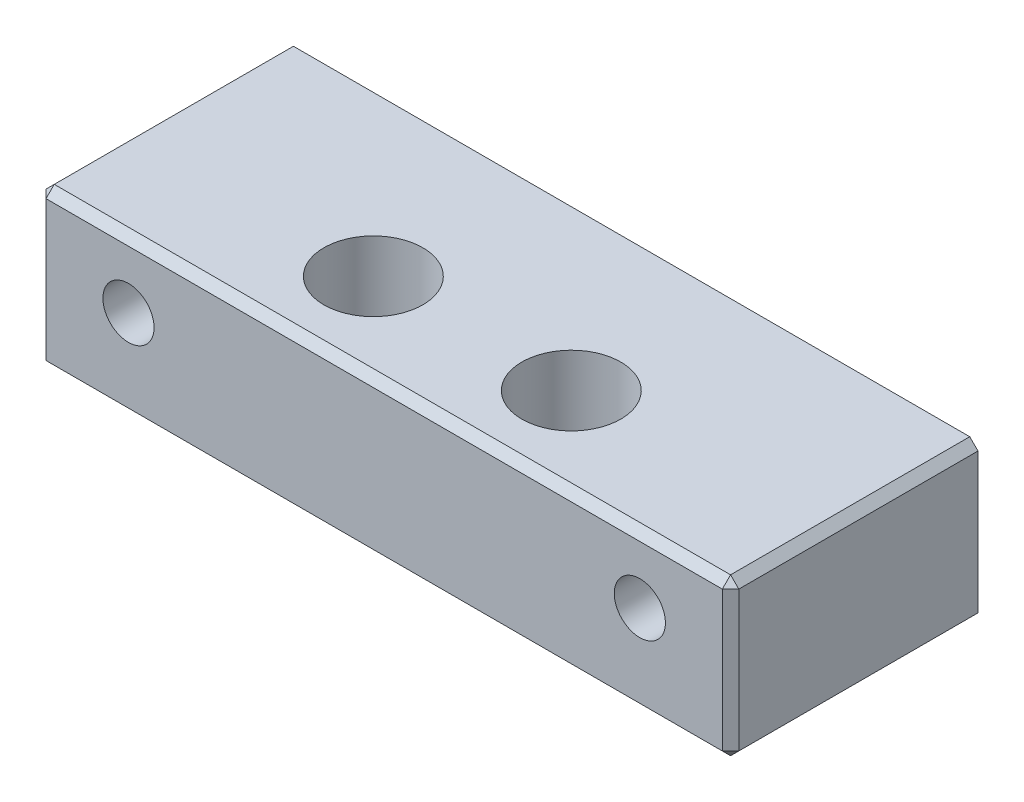
ISO-10303-21;
HEADER;
FILE_DESCRIPTION(('STEP AP214'),'2;1');
FILE_NAME('part.step','',(''),(''),'','','');
FILE_SCHEMA(('AUTOMOTIVE_DESIGN { 1 0 10303 214 1 1 1 1 }'));
ENDSEC;
DATA;
#1=APPLICATION_CONTEXT('core data for automotive mechanical design processes');
#2=APPLICATION_PROTOCOL_DEFINITION('international standard','automotive_design',2000,#1);
#3=PRODUCT_CONTEXT('',#1,'mechanical');
#4=PRODUCT('Part','Part','',(#3));
#5=PRODUCT_RELATED_PRODUCT_CATEGORY('part','',(#4));
#6=PRODUCT_DEFINITION_FORMATION('','',#4);
#7=PRODUCT_DEFINITION_CONTEXT('part definition',#1,'design');
#8=PRODUCT_DEFINITION('design','',#6,#7);
#9=PRODUCT_DEFINITION_SHAPE('','',#8);
#10=(LENGTH_UNIT() NAMED_UNIT(*) SI_UNIT(.MILLI.,.METRE.));
#11=(NAMED_UNIT(*) PLANE_ANGLE_UNIT() SI_UNIT($,.RADIAN.));
#12=(NAMED_UNIT(*) SI_UNIT($,.STERADIAN.) SOLID_ANGLE_UNIT());
#13=UNCERTAINTY_MEASURE_WITH_UNIT(LENGTH_MEASURE(1.E-05),#10,'distance_accuracy_value','');
#14=(GEOMETRIC_REPRESENTATION_CONTEXT(3) GLOBAL_UNCERTAINTY_ASSIGNED_CONTEXT((#13)) GLOBAL_UNIT_ASSIGNED_CONTEXT((#10,
#11,#12)) REPRESENTATION_CONTEXT('',''));
#15=CARTESIAN_POINT('',(0.,0.,0.));
#16=DIRECTION('',(0.,0.,1.));
#17=DIRECTION('',(1.,0.,0.));
#18=AXIS2_PLACEMENT_3D('',#15,#16,#17);
#19=CARTESIAN_POINT('',(21.,-4.75,7.5));
#20=DIRECTION('',(-1.,0.,0.));
#21=DIRECTION('',(0.,0.,1.));
#22=AXIS2_PLACEMENT_3D('',#19,#20,#21);
#23=PLANE('',#22);
#24=DIRECTION('',(0.,1.,0.));
#25=VECTOR('',#24,1.);
#26=CARTESIAN_POINT('',(21.,-4.75,-7.5));
#27=LINE('',#26,#25);
#28=CARTESIAN_POINT('',(21.,-4.25,-7.5));
#29=VERTEX_POINT('',#28);
#30=CARTESIAN_POINT('',(21.,4.24999999999999,-7.5));
#31=VERTEX_POINT('',#30);
#32=EDGE_CURVE('E143',#29,#31,#27,.T.);
#33=ORIENTED_EDGE('',*,*,#32,.T.);
#34=DIRECTION('',(0.,0.,1.));
#35=VECTOR('',#34,1.);
#36=CARTESIAN_POINT('',(21.,4.24999999999999,7.5));
#37=LINE('',#36,#35);
#38=CARTESIAN_POINT('',(21.,4.24999999999999,6.99999999999999));
#39=VERTEX_POINT('',#38);
#40=EDGE_CURVE('E120',#31,#39,#37,.T.);
#41=ORIENTED_EDGE('',*,*,#40,.T.);
#42=DIRECTION('',(0.,-1.,0.));
#43=VECTOR('',#42,1.);
#44=CARTESIAN_POINT('',(21.,-4.75,6.99999999999999));
#45=LINE('',#44,#43);
#46=CARTESIAN_POINT('',(21.,-4.25,6.99999999999999));
#47=VERTEX_POINT('',#46);
#48=EDGE_CURVE('E125',#39,#47,#45,.T.);
#49=ORIENTED_EDGE('',*,*,#48,.T.);
#50=DIRECTION('',(0.,0.,-1.));
#51=VECTOR('',#50,1.);
#52=CARTESIAN_POINT('',(21.,-4.25,7.5));
#53=LINE('',#52,#51);
#54=EDGE_CURVE('E160',#47,#29,#53,.T.);
#55=ORIENTED_EDGE('',*,*,#54,.T.);
#56=EDGE_LOOP('',(#33,#41,#49,#55));
#57=FACE_BOUND('',#56,.T.);
#58=ADVANCED_FACE('F34',(#57),#23,.F.);
#59=CARTESIAN_POINT('',(-21.,4.75,7.5));
#60=DIRECTION('',(0.,-1.,0.));
#61=DIRECTION('',(0.,0.,-1.));
#62=AXIS2_PLACEMENT_3D('',#59,#60,#61);
#63=PLANE('',#62);
#64=CARTESIAN_POINT('',(-6.,4.75,2.155));
#65=DIRECTION('',(0.,1.,0.));
#66=DIRECTION('',(0.,0.,1.));
#67=AXIS2_PLACEMENT_3D('',#64,#65,#66);
#68=CIRCLE('',#67,3.);
#69=CARTESIAN_POINT('',(-6.,4.75,5.155));
#70=VERTEX_POINT('',#69);
#71=EDGE_CURVE('E210',#70,#70,#68,.T.);
#72=ORIENTED_EDGE('',*,*,#71,.F.);
#73=EDGE_LOOP('',(#72));
#74=FACE_BOUND('',#73,.T.);
#75=CARTESIAN_POINT('',(6.,4.75,2.155));
#76=DIRECTION('',(0.,1.,0.));
#77=DIRECTION('',(0.,0.,1.));
#78=AXIS2_PLACEMENT_3D('',#75,#76,#77);
#79=CIRCLE('',#78,3.);
#80=CARTESIAN_POINT('',(6.,4.75,5.155));
#81=VERTEX_POINT('',#80);
#82=EDGE_CURVE('E220',#81,#81,#79,.T.);
#83=ORIENTED_EDGE('',*,*,#82,.F.);
#84=EDGE_LOOP('',(#83));
#85=FACE_BOUND('',#84,.T.);
#86=DIRECTION('',(1.,0.,0.));
#87=VECTOR('',#86,1.);
#88=CARTESIAN_POINT('',(-21.,4.75,6.99999999999999));
#89=LINE('',#88,#87);
#90=CARTESIAN_POINT('',(-20.5,4.75,6.99999999999999));
#91=VERTEX_POINT('',#90);
#92=CARTESIAN_POINT('',(20.5,4.75,6.99999999999999));
#93=VERTEX_POINT('',#92);
#94=EDGE_CURVE('E134',#91,#93,#89,.T.);
#95=ORIENTED_EDGE('',*,*,#94,.T.);
#96=DIRECTION('',(0.,0.,-1.));
#97=VECTOR('',#96,1.);
#98=CARTESIAN_POINT('',(20.5,4.75,7.5));
#99=LINE('',#98,#97);
#100=CARTESIAN_POINT('',(20.5,4.75,-7.5));
#101=VERTEX_POINT('',#100);
#102=EDGE_CURVE('E119',#93,#101,#99,.T.);
#103=ORIENTED_EDGE('',*,*,#102,.T.);
#104=DIRECTION('',(-1.,0.,0.));
#105=VECTOR('',#104,1.);
#106=CARTESIAN_POINT('',(-21.,4.75,-7.5));
#107=LINE('',#106,#105);
#108=CARTESIAN_POINT('',(-20.5,4.75,-7.5));
#109=VERTEX_POINT('',#108);
#110=EDGE_CURVE('E131',#101,#109,#107,.T.);
#111=ORIENTED_EDGE('',*,*,#110,.T.);
#112=DIRECTION('',(0.,0.,1.));
#113=VECTOR('',#112,1.);
#114=CARTESIAN_POINT('',(-20.5,4.75,7.5));
#115=LINE('',#114,#113);
#116=EDGE_CURVE('E136',#109,#91,#115,.T.);
#117=ORIENTED_EDGE('',*,*,#116,.T.);
#118=EDGE_LOOP('',(#95,#103,#111,#117));
#119=FACE_BOUND('',#118,.T.);
#120=ADVANCED_FACE('F130',(#74,#85,#119),#63,.F.);
#121=CARTESIAN_POINT('',(-21.,-4.75,7.5));
#122=DIRECTION('',(1.,0.,0.));
#123=DIRECTION('',(0.,0.,-1.));
#124=AXIS2_PLACEMENT_3D('',#121,#122,#123);
#125=PLANE('',#124);
#126=DIRECTION('',(0.,1.,0.));
#127=VECTOR('',#126,1.);
#128=CARTESIAN_POINT('',(-21.,-4.75,6.99999999999999));
#129=LINE('',#128,#127);
#130=CARTESIAN_POINT('',(-21.,-4.24999999999999,6.99999999999999));
#131=VERTEX_POINT('',#130);
#132=CARTESIAN_POINT('',(-21.,4.24999999999999,6.99999999999999));
#133=VERTEX_POINT('',#132);
#134=EDGE_CURVE('E169',#131,#133,#129,.T.);
#135=ORIENTED_EDGE('',*,*,#134,.T.);
#136=DIRECTION('',(0.,0.,-1.));
#137=VECTOR('',#136,1.);
#138=CARTESIAN_POINT('',(-21.,4.24999999999999,7.5));
#139=LINE('',#138,#137);
#140=CARTESIAN_POINT('',(-21.,4.25,-7.5));
#141=VERTEX_POINT('',#140);
#142=EDGE_CURVE('E173',#133,#141,#139,.T.);
#143=ORIENTED_EDGE('',*,*,#142,.T.);
#144=DIRECTION('',(0.,-1.,0.));
#145=VECTOR('',#144,1.);
#146=CARTESIAN_POINT('',(-21.,-4.75,-7.5));
#147=LINE('',#146,#145);
#148=CARTESIAN_POINT('',(-21.,-4.24999999999999,-7.5));
#149=VERTEX_POINT('',#148);
#150=EDGE_CURVE('E142',#141,#149,#147,.T.);
#151=ORIENTED_EDGE('',*,*,#150,.T.);
#152=DIRECTION('',(0.,0.,1.));
#153=VECTOR('',#152,1.);
#154=CARTESIAN_POINT('',(-21.,-4.24999999999999,7.5));
#155=LINE('',#154,#153);
#156=EDGE_CURVE('E171',#149,#131,#155,.T.);
#157=ORIENTED_EDGE('',*,*,#156,.T.);
#158=EDGE_LOOP('',(#135,#143,#151,#157));
#159=FACE_BOUND('',#158,.T.);
#160=ADVANCED_FACE('F251',(#159),#125,.F.);
#161=CARTESIAN_POINT('',(-21.,-4.75,7.5));
#162=DIRECTION('',(0.,1.,0.));
#163=DIRECTION('',(0.,0.,1.));
#164=AXIS2_PLACEMENT_3D('',#161,#162,#163);
#165=PLANE('',#164);
#166=DIRECTION('',(1.,0.,0.));
#167=VECTOR('',#166,1.);
#168=CARTESIAN_POINT('',(-21.,-4.75,-7.5));
#169=LINE('',#168,#167);
#170=CARTESIAN_POINT('',(-20.5,-4.75,-7.5));
#171=VERTEX_POINT('',#170);
#172=CARTESIAN_POINT('',(20.5,-4.75,-7.5));
#173=VERTEX_POINT('',#172);
#174=EDGE_CURVE('E146',#171,#173,#169,.T.);
#175=ORIENTED_EDGE('',*,*,#174,.T.);
#176=DIRECTION('',(0.,0.,1.));
#177=VECTOR('',#176,1.);
#178=CARTESIAN_POINT('',(20.5,-4.75,7.5));
#179=LINE('',#178,#177);
#180=CARTESIAN_POINT('',(20.5,-4.75,6.99999999999999));
#181=VERTEX_POINT('',#180);
#182=EDGE_CURVE('E167',#173,#181,#179,.T.);
#183=ORIENTED_EDGE('',*,*,#182,.T.);
#184=DIRECTION('',(-1.,0.,0.));
#185=VECTOR('',#184,1.);
#186=CARTESIAN_POINT('',(-21.,-4.75,6.99999999999999));
#187=LINE('',#186,#185);
#188=CARTESIAN_POINT('',(-20.5,-4.75,6.99999999999999));
#189=VERTEX_POINT('',#188);
#190=EDGE_CURVE('E163',#181,#189,#187,.T.);
#191=ORIENTED_EDGE('',*,*,#190,.T.);
#192=DIRECTION('',(0.,0.,-1.));
#193=VECTOR('',#192,1.);
#194=CARTESIAN_POINT('',(-20.5,-4.75,7.5));
#195=LINE('',#194,#193);
#196=EDGE_CURVE('E165',#189,#171,#195,.T.);
#197=ORIENTED_EDGE('',*,*,#196,.T.);
#198=EDGE_LOOP('',(#175,#183,#191,#197));
#199=FACE_BOUND('',#198,.T.);
#200=CARTESIAN_POINT('',(-6.,-4.75,2.155));
#201=DIRECTION('',(0.,1.,0.));
#202=DIRECTION('',(0.,0.,1.));
#203=AXIS2_PLACEMENT_3D('',#200,#201,#202);
#204=CIRCLE('',#203,3.);
#205=CARTESIAN_POINT('',(-6.,-4.75,5.155));
#206=VERTEX_POINT('',#205);
#207=EDGE_CURVE('E215',#206,#206,#204,.T.);
#208=ORIENTED_EDGE('',*,*,#207,.T.);
#209=EDGE_LOOP('',(#208));
#210=FACE_BOUND('',#209,.T.);
#211=CARTESIAN_POINT('',(6.,-4.75,2.155));
#212=DIRECTION('',(0.,1.,0.));
#213=DIRECTION('',(0.,0.,1.));
#214=AXIS2_PLACEMENT_3D('',#211,#212,#213);
#215=CIRCLE('',#214,3.);
#216=CARTESIAN_POINT('',(6.,-4.75,5.155));
#217=VERTEX_POINT('',#216);
#218=EDGE_CURVE('E223',#217,#217,#215,.T.);
#219=ORIENTED_EDGE('',*,*,#218,.T.);
#220=EDGE_LOOP('',(#219));
#221=FACE_BOUND('',#220,.T.);
#222=ADVANCED_FACE('F243',(#199,#210,#221),#165,.F.);
#223=CARTESIAN_POINT('',(21.,4.75,7.5));
#224=DIRECTION('',(0.,0.,-1.));
#225=DIRECTION('',(-1.,0.,0.));
#226=AXIS2_PLACEMENT_3D('',#223,#224,#225);
#227=PLANE('',#226);
#228=DIRECTION('',(1.,0.,0.));
#229=VECTOR('',#228,1.);
#230=CARTESIAN_POINT('',(21.,-4.25,7.5));
#231=LINE('',#230,#229);
#232=CARTESIAN_POINT('',(-20.5,-4.25,7.5));
#233=VERTEX_POINT('',#232);
#234=CARTESIAN_POINT('',(20.5,-4.25,7.5));
#235=VERTEX_POINT('',#234);
#236=EDGE_CURVE('E58',#233,#235,#231,.T.);
#237=ORIENTED_EDGE('',*,*,#236,.T.);
#238=DIRECTION('',(0.,1.,0.));
#239=VECTOR('',#238,1.);
#240=CARTESIAN_POINT('',(20.5,4.75,7.5));
#241=LINE('',#240,#239);
#242=CARTESIAN_POINT('',(20.5,4.25,7.5));
#243=VERTEX_POINT('',#242);
#244=EDGE_CURVE('E11',#235,#243,#241,.T.);
#245=ORIENTED_EDGE('',*,*,#244,.T.);
#246=DIRECTION('',(-1.,0.,0.));
#247=VECTOR('',#246,1.);
#248=CARTESIAN_POINT('',(21.,4.25,7.5));
#249=LINE('',#248,#247);
#250=CARTESIAN_POINT('',(-20.5,4.25,7.5));
#251=VERTEX_POINT('',#250);
#252=EDGE_CURVE('E43',#243,#251,#249,.T.);
#253=ORIENTED_EDGE('',*,*,#252,.T.);
#254=DIRECTION('',(0.,-1.,0.));
#255=VECTOR('',#254,1.);
#256=CARTESIAN_POINT('',(-20.5,4.75,7.5));
#257=LINE('',#256,#255);
#258=EDGE_CURVE('E175',#251,#233,#257,.T.);
#259=ORIENTED_EDGE('',*,*,#258,.T.);
#260=EDGE_LOOP('',(#237,#245,#253,#259));
#261=FACE_BOUND('',#260,.T.);
#262=CARTESIAN_POINT('',(15.5,0.750000000000005,7.5));
#263=DIRECTION('',(0.,0.,1.));
#264=DIRECTION('',(1.,0.,0.));
#265=AXIS2_PLACEMENT_3D('',#262,#263,#264);
#266=CIRCLE('',#265,1.55);
#267=CARTESIAN_POINT('',(17.05,0.750000000000005,7.5));
#268=VERTEX_POINT('',#267);
#269=EDGE_CURVE('E226',#268,#268,#266,.T.);
#270=ORIENTED_EDGE('',*,*,#269,.F.);
#271=EDGE_LOOP('',(#270));
#272=FACE_BOUND('',#271,.T.);
#273=CARTESIAN_POINT('',(-15.5,0.750000000000002,7.5));
#274=DIRECTION('',(0.,0.,1.));
#275=DIRECTION('',(1.,0.,0.));
#276=AXIS2_PLACEMENT_3D('',#273,#274,#275);
#277=CIRCLE('',#276,1.55);
#278=CARTESIAN_POINT('',(-13.95,0.750000000000002,7.5));
#279=VERTEX_POINT('',#278);
#280=EDGE_CURVE('E232',#279,#279,#277,.T.);
#281=ORIENTED_EDGE('',*,*,#280,.F.);
#282=EDGE_LOOP('',(#281));
#283=FACE_BOUND('',#282,.T.);
#284=ADVANCED_FACE('F241',(#261,#272,#283),#227,.F.);
#285=CARTESIAN_POINT('',(21.,4.75,-7.5));
#286=DIRECTION('',(0.,0.,-1.));
#287=DIRECTION('',(-1.,0.,0.));
#288=AXIS2_PLACEMENT_3D('',#285,#286,#287);
#289=PLANE('',#288);
#290=CARTESIAN_POINT('',(15.5,0.750000000000005,-7.5));
#291=DIRECTION('',(0.,0.,1.));
#292=DIRECTION('',(1.,0.,0.));
#293=AXIS2_PLACEMENT_3D('',#290,#291,#292);
#294=CIRCLE('',#293,1.55);
#295=CARTESIAN_POINT('',(17.05,0.750000000000005,-7.5));
#296=VERTEX_POINT('',#295);
#297=EDGE_CURVE('E229',#296,#296,#294,.T.);
#298=ORIENTED_EDGE('',*,*,#297,.T.);
#299=EDGE_LOOP('',(#298));
#300=FACE_BOUND('',#299,.T.);
#301=CARTESIAN_POINT('',(-15.5,0.750000000000002,-7.5));
#302=DIRECTION('',(0.,0.,1.));
#303=DIRECTION('',(1.,0.,0.));
#304=AXIS2_PLACEMENT_3D('',#301,#302,#303);
#305=CIRCLE('',#304,1.55);
#306=CARTESIAN_POINT('',(-13.95,0.750000000000002,-7.5));
#307=VERTEX_POINT('',#306);
#308=EDGE_CURVE('E148',#307,#307,#305,.T.);
#309=ORIENTED_EDGE('',*,*,#308,.T.);
#310=EDGE_LOOP('',(#309));
#311=FACE_BOUND('',#310,.T.);
#312=ORIENTED_EDGE('',*,*,#110,.F.);
#313=DIRECTION('',(-0.707106781186543,0.707106781186552,0.));
#314=VECTOR('',#313,1.);
#315=CARTESIAN_POINT('',(20.75,4.50000000000001,-7.5));
#316=LINE('',#315,#314);
#317=EDGE_CURVE('E115',#101,#31,#316,.F.);
#318=ORIENTED_EDGE('',*,*,#317,.T.);
#319=ORIENTED_EDGE('',*,*,#32,.F.);
#320=DIRECTION('',(0.707106781186552,0.707106781186543,0.));
#321=VECTOR('',#320,1.);
#322=CARTESIAN_POINT('',(25.5,0.249999999999932,-7.5));
#323=LINE('',#322,#321);
#324=EDGE_CURVE('E126',#29,#173,#323,.F.);
#325=ORIENTED_EDGE('',*,*,#324,.T.);
#326=ORIENTED_EDGE('',*,*,#174,.F.);
#327=DIRECTION('',(0.707106781186543,-0.707106781186552,0.));
#328=VECTOR('',#327,1.);
#329=CARTESIAN_POINT('',(-4.50000000000029,-20.7499999999999,-7.5));
#330=LINE('',#329,#328);
#331=EDGE_CURVE('E135',#171,#149,#330,.F.);
#332=ORIENTED_EDGE('',*,*,#331,.T.);
#333=ORIENTED_EDGE('',*,*,#150,.F.);
#334=DIRECTION('',(-0.707106781186543,-0.707106781186552,0.));
#335=VECTOR('',#334,1.);
#336=CARTESIAN_POINT('',(0.249999999999705,25.5,-7.5));
#337=LINE('',#336,#335);
#338=EDGE_CURVE('E141',#141,#109,#337,.F.);
#339=ORIENTED_EDGE('',*,*,#338,.T.);
#340=EDGE_LOOP('',(#312,#318,#319,#325,#326,#332,#333,#339));
#341=FACE_BOUND('',#340,.T.);
#342=ADVANCED_FACE('F138',(#300,#311,#341),#289,.T.);
#343=CARTESIAN_POINT('',(-15.5,0.750000000000002,-7.5));
#344=DIRECTION('',(0.,0.,1.));
#345=DIRECTION('',(1.,0.,0.));
#346=AXIS2_PLACEMENT_3D('',#343,#344,#345);
#347=CYLINDRICAL_SURFACE('',#346,1.55);
#348=ORIENTED_EDGE('',*,*,#308,.F.);
#349=EDGE_LOOP('',(#348));
#350=FACE_BOUND('',#349,.T.);
#351=ORIENTED_EDGE('',*,*,#280,.T.);
#352=EDGE_LOOP('',(#351));
#353=FACE_BOUND('',#352,.T.);
#354=ADVANCED_FACE('F239',(#350,#353),#347,.F.);
#355=CARTESIAN_POINT('',(15.5,0.750000000000005,-7.5));
#356=DIRECTION('',(0.,0.,1.));
#357=DIRECTION('',(1.,0.,0.));
#358=AXIS2_PLACEMENT_3D('',#355,#356,#357);
#359=CYLINDRICAL_SURFACE('',#358,1.55);
#360=ORIENTED_EDGE('',*,*,#297,.F.);
#361=EDGE_LOOP('',(#360));
#362=FACE_BOUND('',#361,.T.);
#363=ORIENTED_EDGE('',*,*,#269,.T.);
#364=EDGE_LOOP('',(#363));
#365=FACE_BOUND('',#364,.T.);
#366=ADVANCED_FACE('F335',(#362,#365),#359,.F.);
#367=CARTESIAN_POINT('',(6.,-4.75,2.155));
#368=DIRECTION('',(0.,1.,0.));
#369=DIRECTION('',(0.,0.,1.));
#370=AXIS2_PLACEMENT_3D('',#367,#368,#369);
#371=CYLINDRICAL_SURFACE('',#370,3.);
#372=ORIENTED_EDGE('',*,*,#218,.F.);
#373=EDGE_LOOP('',(#372));
#374=FACE_BOUND('',#373,.T.);
#375=ORIENTED_EDGE('',*,*,#82,.T.);
#376=EDGE_LOOP('',(#375));
#377=FACE_BOUND('',#376,.T.);
#378=ADVANCED_FACE('F332',(#374,#377),#371,.F.);
#379=CARTESIAN_POINT('',(-6.,-4.75,2.155));
#380=DIRECTION('',(0.,1.,0.));
#381=DIRECTION('',(0.,0.,1.));
#382=AXIS2_PLACEMENT_3D('',#379,#380,#381);
#383=CYLINDRICAL_SURFACE('',#382,3.);
#384=ORIENTED_EDGE('',*,*,#207,.F.);
#385=EDGE_LOOP('',(#384));
#386=FACE_BOUND('',#385,.T.);
#387=ORIENTED_EDGE('',*,*,#71,.T.);
#388=EDGE_LOOP('',(#387));
#389=FACE_BOUND('',#388,.T.);
#390=ADVANCED_FACE('F306',(#386,#389),#383,.F.);
#391=CARTESIAN_POINT('',(-20.5,-4.75,7.5));
#392=DIRECTION('',(0.707106781186552,0.707106781186542,0.));
#393=DIRECTION('',(-0.707106781186543,0.707106781186552,0.));
#394=AXIS2_PLACEMENT_3D('',#391,#392,#393);
#395=PLANE('',#394);
#396=DIRECTION('',(-0.707106781186543,0.707106781186552,0.));
#397=VECTOR('',#396,1.);
#398=CARTESIAN_POINT('',(-21.,-4.24999999999999,6.99999999999999));
#399=LINE('',#398,#397);
#400=EDGE_CURVE('E38',#131,#189,#399,.F.);
#401=ORIENTED_EDGE('',*,*,#400,.F.);
#402=ORIENTED_EDGE('',*,*,#156,.F.);
#403=ORIENTED_EDGE('',*,*,#331,.F.);
#404=ORIENTED_EDGE('',*,*,#196,.F.);
#405=EDGE_LOOP('',(#401,#402,#403,#404));
#406=FACE_BOUND('',#405,.T.);
#407=ADVANCED_FACE('F36',(#406),#395,.F.);
#408=CARTESIAN_POINT('',(-21.,-4.24999999999999,6.99999999999999));
#409=DIRECTION('',(-0.577350269189634,-0.577350269189626,0.577350269189618));
#410=DIRECTION('',(0.707106781186543,-0.707106781186552,0.));
#411=AXIS2_PLACEMENT_3D('',#408,#409,#410);
#412=PLANE('',#411);
#413=DIRECTION('',(0.707106781186543,0.,0.707106781186552));
#414=VECTOR('',#413,1.);
#415=CARTESIAN_POINT('',(-21.,-4.24999999999999,6.99999999999999));
#416=LINE('',#415,#414);
#417=EDGE_CURVE('E202',#131,#233,#416,.T.);
#418=ORIENTED_EDGE('',*,*,#417,.F.);
#419=ORIENTED_EDGE('',*,*,#400,.T.);
#420=DIRECTION('',(0.,-0.707106781186543,-0.707106781186552));
#421=VECTOR('',#420,1.);
#422=CARTESIAN_POINT('',(-20.5,-4.5,7.25));
#423=LINE('',#422,#421);
#424=EDGE_CURVE('E204',#233,#189,#423,.T.);
#425=ORIENTED_EDGE('',*,*,#424,.F.);
#426=EDGE_LOOP('',(#418,#419,#425));
#427=FACE_BOUND('',#426,.T.);
#428=ADVANCED_FACE('F300',(#427),#412,.T.);
#429=CARTESIAN_POINT('',(21.,-4.25,7.5));
#430=DIRECTION('',(-0.707106781186542,0.707106781186552,0.));
#431=DIRECTION('',(-0.707106781186552,-0.707106781186543,0.));
#432=AXIS2_PLACEMENT_3D('',#429,#430,#431);
#433=PLANE('',#432);
#434=ORIENTED_EDGE('',*,*,#324,.F.);
#435=ORIENTED_EDGE('',*,*,#54,.F.);
#436=DIRECTION('',(-0.707106781186552,-0.707106781186543,0.));
#437=VECTOR('',#436,1.);
#438=CARTESIAN_POINT('',(20.5,-4.75,6.99999999999999));
#439=LINE('',#438,#437);
#440=EDGE_CURVE('E199',#181,#47,#439,.F.);
#441=ORIENTED_EDGE('',*,*,#440,.F.);
#442=ORIENTED_EDGE('',*,*,#182,.F.);
#443=EDGE_LOOP('',(#434,#435,#441,#442));
#444=FACE_BOUND('',#443,.T.);
#445=ADVANCED_FACE('F298',(#444),#433,.F.);
#446=CARTESIAN_POINT('',(21.,-4.25,7.5));
#447=DIRECTION('',(0.,0.707106781186552,-0.707106781186542));
#448=DIRECTION('',(0.,0.707106781186543,0.707106781186552));
#449=AXIS2_PLACEMENT_3D('',#446,#447,#448);
#450=PLANE('',#449);
#451=ORIENTED_EDGE('',*,*,#424,.T.);
#452=ORIENTED_EDGE('',*,*,#190,.F.);
#453=DIRECTION('',(0.,0.707106781186543,0.707106781186552));
#454=VECTOR('',#453,1.);
#455=CARTESIAN_POINT('',(20.5,-4.75,6.99999999999999));
#456=LINE('',#455,#454);
#457=EDGE_CURVE('E196',#235,#181,#456,.F.);
#458=ORIENTED_EDGE('',*,*,#457,.F.);
#459=ORIENTED_EDGE('',*,*,#236,.F.);
#460=EDGE_LOOP('',(#451,#452,#458,#459));
#461=FACE_BOUND('',#460,.T.);
#462=ADVANCED_FACE('F294',(#461),#450,.F.);
#463=CARTESIAN_POINT('',(-20.5,4.75,7.5));
#464=DIRECTION('',(0.707106781186552,0.,-0.707106781186542));
#465=DIRECTION('',(-0.707106781186543,0.,-0.707106781186552));
#466=AXIS2_PLACEMENT_3D('',#463,#464,#465);
#467=PLANE('',#466);
#468=ORIENTED_EDGE('',*,*,#417,.T.);
#469=ORIENTED_EDGE('',*,*,#258,.F.);
#470=DIRECTION('',(-0.707106781186543,0.,-0.707106781186552));
#471=VECTOR('',#470,1.);
#472=CARTESIAN_POINT('',(-20.75,4.25,7.25));
#473=LINE('',#472,#471);
#474=EDGE_CURVE('E193',#133,#251,#473,.F.);
#475=ORIENTED_EDGE('',*,*,#474,.F.);
#476=ORIENTED_EDGE('',*,*,#134,.F.);
#477=EDGE_LOOP('',(#468,#469,#475,#476));
#478=FACE_BOUND('',#477,.T.);
#479=ADVANCED_FACE('F290',(#478),#467,.F.);
#480=CARTESIAN_POINT('',(-21.,4.24999999999999,7.5));
#481=DIRECTION('',(0.707106781186552,-0.707106781186542,0.));
#482=DIRECTION('',(0.707106781186543,0.707106781186552,0.));
#483=AXIS2_PLACEMENT_3D('',#480,#481,#482);
#484=PLANE('',#483);
#485=ORIENTED_EDGE('',*,*,#338,.F.);
#486=ORIENTED_EDGE('',*,*,#142,.F.);
#487=DIRECTION('',(0.707106781186543,0.707106781186552,0.));
#488=VECTOR('',#487,1.);
#489=CARTESIAN_POINT('',(-20.5,4.75,6.99999999999999));
#490=LINE('',#489,#488);
#491=EDGE_CURVE('E190',#91,#133,#490,.F.);
#492=ORIENTED_EDGE('',*,*,#491,.F.);
#493=ORIENTED_EDGE('',*,*,#116,.F.);
#494=EDGE_LOOP('',(#485,#486,#492,#493));
#495=FACE_BOUND('',#494,.T.);
#496=ADVANCED_FACE('F286',(#495),#484,.F.);
#497=CARTESIAN_POINT('',(20.5,-4.75,6.99999999999999));
#498=DIRECTION('',(0.577350269189626,-0.577350269189634,0.577350269189618));
#499=DIRECTION('',(0.707106781186552,0.707106781186543,0.));
#500=AXIS2_PLACEMENT_3D('',#497,#498,#499);
#501=PLANE('',#500);
#502=ORIENTED_EDGE('',*,*,#457,.T.);
#503=ORIENTED_EDGE('',*,*,#440,.T.);
#504=DIRECTION('',(0.707106781186543,0.,-0.707106781186552));
#505=VECTOR('',#504,1.);
#506=CARTESIAN_POINT('',(20.75,-4.25,7.25));
#507=LINE('',#506,#505);
#508=EDGE_CURVE('E187',#235,#47,#507,.T.);
#509=ORIENTED_EDGE('',*,*,#508,.F.);
#510=EDGE_LOOP('',(#502,#503,#509));
#511=FACE_BOUND('',#510,.T.);
#512=ADVANCED_FACE('F282',(#511),#501,.T.);
#513=CARTESIAN_POINT('',(-20.5,4.75,6.99999999999999));
#514=DIRECTION('',(-0.577350269189634,0.577350269189626,0.577350269189618));
#515=DIRECTION('',(-0.707106781186543,-0.707106781186552,0.));
#516=AXIS2_PLACEMENT_3D('',#513,#514,#515);
#517=PLANE('',#516);
#518=ORIENTED_EDGE('',*,*,#491,.T.);
#519=ORIENTED_EDGE('',*,*,#474,.T.);
#520=DIRECTION('',(0.,-0.707106781186543,0.707106781186552));
#521=VECTOR('',#520,1.);
#522=CARTESIAN_POINT('',(-20.5,4.75,6.99999999999999));
#523=LINE('',#522,#521);
#524=EDGE_CURVE('E184',#91,#251,#523,.T.);
#525=ORIENTED_EDGE('',*,*,#524,.F.);
#526=EDGE_LOOP('',(#518,#519,#525));
#527=FACE_BOUND('',#526,.T.);
#528=ADVANCED_FACE('F278',(#527),#517,.T.);
#529=CARTESIAN_POINT('',(20.5,4.75,7.5));
#530=DIRECTION('',(-0.707106781186552,0.,-0.707106781186542));
#531=DIRECTION('',(-0.707106781186543,0.,0.707106781186552));
#532=AXIS2_PLACEMENT_3D('',#529,#530,#531);
#533=PLANE('',#532);
#534=ORIENTED_EDGE('',*,*,#508,.T.);
#535=ORIENTED_EDGE('',*,*,#48,.F.);
#536=DIRECTION('',(-0.707106781186543,0.,0.707106781186552));
#537=VECTOR('',#536,1.);
#538=CARTESIAN_POINT('',(21.,4.24999999999999,6.99999999999999));
#539=LINE('',#538,#537);
#540=EDGE_CURVE('E182',#243,#39,#539,.F.);
#541=ORIENTED_EDGE('',*,*,#540,.F.);
#542=ORIENTED_EDGE('',*,*,#244,.F.);
#543=EDGE_LOOP('',(#534,#535,#541,#542));
#544=FACE_BOUND('',#543,.T.);
#545=ADVANCED_FACE('F274',(#544),#533,.F.);
#546=CARTESIAN_POINT('',(21.,4.25,7.5));
#547=DIRECTION('',(0.,-0.707106781186552,-0.707106781186542));
#548=DIRECTION('',(0.,0.707106781186543,-0.707106781186552));
#549=AXIS2_PLACEMENT_3D('',#546,#547,#548);
#550=PLANE('',#549);
#551=ORIENTED_EDGE('',*,*,#524,.T.);
#552=ORIENTED_EDGE('',*,*,#252,.F.);
#553=DIRECTION('',(0.,0.707106781186543,-0.707106781186552));
#554=VECTOR('',#553,1.);
#555=CARTESIAN_POINT('',(20.5,4.5,7.25));
#556=LINE('',#555,#554);
#557=EDGE_CURVE('E51',#93,#243,#556,.F.);
#558=ORIENTED_EDGE('',*,*,#557,.F.);
#559=ORIENTED_EDGE('',*,*,#94,.F.);
#560=EDGE_LOOP('',(#551,#552,#558,#559));
#561=FACE_BOUND('',#560,.T.);
#562=ADVANCED_FACE('F271',(#561),#550,.F.);
#563=CARTESIAN_POINT('',(21.,4.24999999999999,6.99999999999999));
#564=DIRECTION('',(0.577350269189634,0.577350269189626,0.577350269189618));
#565=DIRECTION('',(-0.707106781186543,0.707106781186552,0.));
#566=AXIS2_PLACEMENT_3D('',#563,#564,#565);
#567=PLANE('',#566);
#568=ORIENTED_EDGE('',*,*,#557,.T.);
#569=ORIENTED_EDGE('',*,*,#540,.T.);
#570=DIRECTION('',(0.707106781186543,-0.707106781186552,0.));
#571=VECTOR('',#570,1.);
#572=CARTESIAN_POINT('',(21.,4.24999999999999,6.99999999999999));
#573=LINE('',#572,#571);
#574=EDGE_CURVE('E179',#93,#39,#573,.T.);
#575=ORIENTED_EDGE('',*,*,#574,.F.);
#576=EDGE_LOOP('',(#568,#569,#575));
#577=FACE_BOUND('',#576,.T.);
#578=ADVANCED_FACE('F268',(#577),#567,.T.);
#579=CARTESIAN_POINT('',(20.5,4.75,7.5));
#580=DIRECTION('',(-0.707106781186552,-0.707106781186542,0.));
#581=DIRECTION('',(0.707106781186543,-0.707106781186552,0.));
#582=AXIS2_PLACEMENT_3D('',#579,#580,#581);
#583=PLANE('',#582);
#584=ORIENTED_EDGE('',*,*,#574,.T.);
#585=ORIENTED_EDGE('',*,*,#40,.F.);
#586=ORIENTED_EDGE('',*,*,#317,.F.);
#587=ORIENTED_EDGE('',*,*,#102,.F.);
#588=EDGE_LOOP('',(#584,#585,#586,#587));
#589=FACE_BOUND('',#588,.T.);
#590=ADVANCED_FACE('F118',(#589),#583,.F.);
#591=CLOSED_SHELL('',(#58,#120,#160,#222,#284,#342,#354,#366,#378,#390,#407,#428,#445,#462,#479,
#496,#512,#528,#545,#562,#578,#590));
#592=MANIFOLD_SOLID_BREP('B2',#591);
#593=ADVANCED_BREP_SHAPE_REPRESENTATION('',(#18,#592),#14);
#594=SHAPE_DEFINITION_REPRESENTATION(#9,#593);
ENDSEC;
END-ISO-10303-21;
